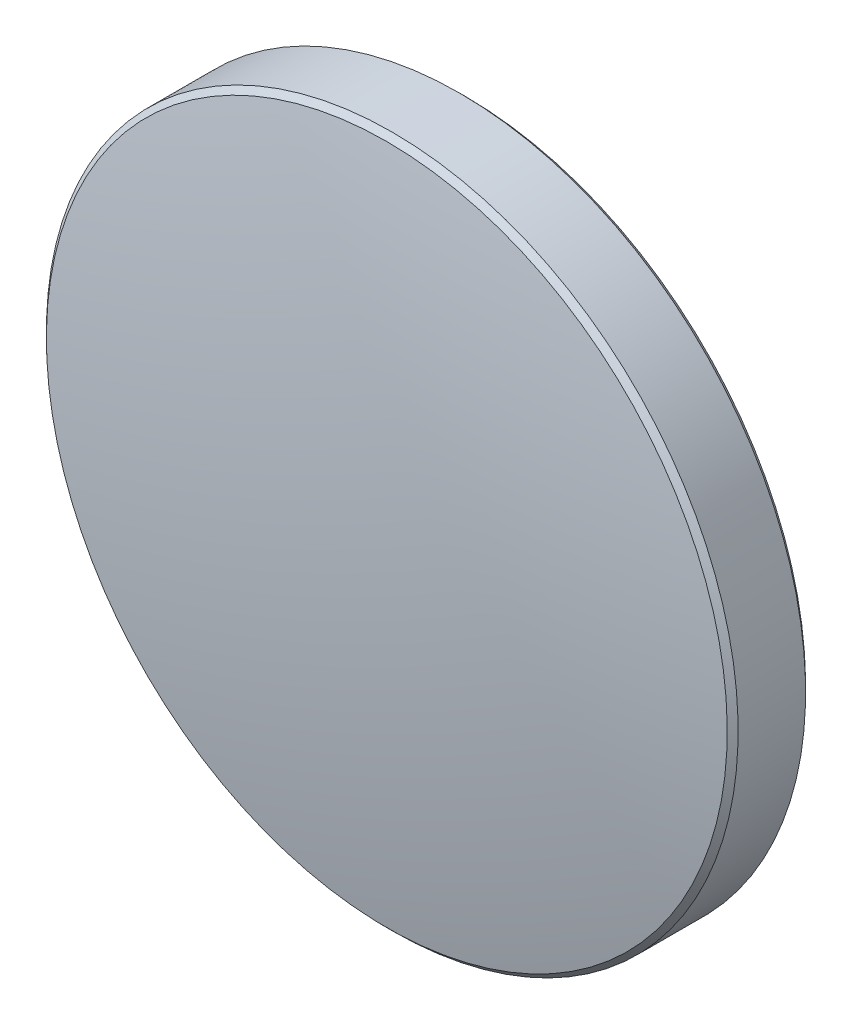
ISO-10303-21;
HEADER;
FILE_DESCRIPTION(('STEP AP214'),'2;1');
FILE_NAME('part.step','',(''),(''),'','','');
FILE_SCHEMA(('AUTOMOTIVE_DESIGN { 1 0 10303 214 1 1 1 1 }'));
ENDSEC;
DATA;
#1=APPLICATION_CONTEXT('core data for automotive mechanical design processes');
#2=APPLICATION_PROTOCOL_DEFINITION('international standard','automotive_design',2000,#1);
#3=PRODUCT_CONTEXT('',#1,'mechanical');
#4=PRODUCT('Part','Part','',(#3));
#5=PRODUCT_RELATED_PRODUCT_CATEGORY('part','',(#4));
#6=PRODUCT_DEFINITION_FORMATION('','',#4);
#7=PRODUCT_DEFINITION_CONTEXT('part definition',#1,'design');
#8=PRODUCT_DEFINITION('design','',#6,#7);
#9=PRODUCT_DEFINITION_SHAPE('','',#8);
#10=(LENGTH_UNIT() NAMED_UNIT(*) SI_UNIT(.MILLI.,.METRE.));
#11=(NAMED_UNIT(*) PLANE_ANGLE_UNIT() SI_UNIT($,.RADIAN.));
#12=(NAMED_UNIT(*) SI_UNIT($,.STERADIAN.) SOLID_ANGLE_UNIT());
#13=UNCERTAINTY_MEASURE_WITH_UNIT(LENGTH_MEASURE(1.E-05),#10,'distance_accuracy_value','');
#14=(GEOMETRIC_REPRESENTATION_CONTEXT(3) GLOBAL_UNCERTAINTY_ASSIGNED_CONTEXT((#13)) GLOBAL_UNIT_ASSIGNED_CONTEXT((#10,
#11,#12)) REPRESENTATION_CONTEXT('',''));
#15=CARTESIAN_POINT('',(0.,0.,0.));
#16=DIRECTION('',(0.,0.,1.));
#17=DIRECTION('',(1.,0.,0.));
#18=AXIS2_PLACEMENT_3D('',#15,#16,#17);
#19=CARTESIAN_POINT('',(0.,0.,-2.));
#20=DIRECTION('',(0.,0.,-1.));
#21=DIRECTION('',(0.,1.,0.));
#22=AXIS2_PLACEMENT_3D('',#19,#20,#21);
#23=CYLINDRICAL_SURFACE('',#22,12.7);
#24=CARTESIAN_POINT('',(0.,0.,0.678144155731215));
#25=DIRECTION('',(0.,0.,-1.));
#26=DIRECTION('',(0.,1.,0.));
#27=AXIS2_PLACEMENT_3D('',#24,#25,#26);
#28=CIRCLE('',#27,12.7);
#29=CARTESIAN_POINT('',(0.,12.7,0.678144155731161));
#30=VERTEX_POINT('',#29);
#31=EDGE_CURVE('E28',#30,#30,#28,.T.);
#32=ORIENTED_EDGE('',*,*,#31,.T.);
#33=EDGE_LOOP('',(#32));
#34=FACE_BOUND('',#33,.T.);
#35=CARTESIAN_POINT('',(0.,0.,-1.79999999999995));
#36=DIRECTION('',(0.,0.,-1.));
#37=DIRECTION('',(0.,1.,0.));
#38=AXIS2_PLACEMENT_3D('',#35,#36,#37);
#39=CIRCLE('',#38,12.7);
#40=CARTESIAN_POINT('',(0.,12.7,-1.8));
#41=VERTEX_POINT('',#40);
#42=EDGE_CURVE('E20',#41,#41,#39,.T.);
#43=ORIENTED_EDGE('',*,*,#42,.F.);
#44=EDGE_LOOP('',(#43));
#45=FACE_BOUND('',#44,.T.);
#46=ADVANCED_FACE('F13',(#34,#45),#23,.T.);
#47=CARTESIAN_POINT('',(0.,0.,-1.79999999999995));
#48=DIRECTION('',(0.,0.,1.));
#49=DIRECTION('',(0.,-1.,0.));
#50=AXIS2_PLACEMENT_3D('',#47,#48,#49);
#51=CONICAL_SURFACE('',#50,12.7,0.785398163397448);
#52=CARTESIAN_POINT('',(0.,0.,-1.99999999999995));
#53=DIRECTION('',(0.,0.,-1.));
#54=DIRECTION('',(0.,1.,0.));
#55=AXIS2_PLACEMENT_3D('',#52,#53,#54);
#56=CIRCLE('',#55,12.5);
#57=CARTESIAN_POINT('',(0.,12.5,-2.));
#58=VERTEX_POINT('',#57);
#59=EDGE_CURVE('E9',#58,#58,#56,.T.);
#60=ORIENTED_EDGE('',*,*,#59,.F.);
#61=EDGE_LOOP('',(#60));
#62=FACE_BOUND('',#61,.T.);
#63=ORIENTED_EDGE('',*,*,#42,.T.);
#64=EDGE_LOOP('',(#63));
#65=FACE_BOUND('',#64,.T.);
#66=ADVANCED_FACE('F49',(#62,#65),#51,.T.);
#67=CARTESIAN_POINT('',(0.,0.,-2.));
#68=DIRECTION('',(0.,0.,-1.));
#69=DIRECTION('',(0.,1.,0.));
#70=AXIS2_PLACEMENT_3D('',#67,#68,#69);
#71=PLANE('',#70);
#72=ORIENTED_EDGE('',*,*,#59,.T.);
#73=EDGE_LOOP('',(#72));
#74=FACE_BOUND('',#73,.T.);
#75=ADVANCED_FACE('F15',(#74),#71,.T.);
#76=CARTESIAN_POINT('',(0.,0.,0.878144155731214));
#77=DIRECTION('',(0.,0.,-1.));
#78=DIRECTION('',(0.,1.,0.));
#79=AXIS2_PLACEMENT_3D('',#76,#77,#78);
#80=CONICAL_SURFACE('',#79,12.5,0.785398163397456);
#81=ORIENTED_EDGE('',*,*,#31,.F.);
#82=EDGE_LOOP('',(#81));
#83=FACE_BOUND('',#82,.T.);
#84=CARTESIAN_POINT('',(0.,0.,0.878144155731214));
#85=DIRECTION('',(0.,0.,-1.));
#86=DIRECTION('',(0.,1.,0.));
#87=AXIS2_PLACEMENT_3D('',#84,#85,#86);
#88=CIRCLE('',#87,12.5);
#89=CARTESIAN_POINT('',(0.,12.5,0.878144155731161));
#90=VERTEX_POINT('',#89);
#91=EDGE_CURVE('E24',#90,#90,#88,.T.);
#92=ORIENTED_EDGE('',*,*,#91,.T.);
#93=EDGE_LOOP('',(#92));
#94=FACE_BOUND('',#93,.T.);
#95=ADVANCED_FACE('F36',(#83,#94),#80,.T.);
#96=CARTESIAN_POINT('',(0.,0.,-68.2));
#97=DIRECTION('',(0.,0.,-1.));
#98=DIRECTION('',(0.,1.,0.));
#99=AXIS2_PLACEMENT_3D('',#96,#97,#98);
#100=SPHERICAL_SURFACE('',#99,70.1999999999999);
#101=ORIENTED_EDGE('',*,*,#91,.F.);
#102=EDGE_LOOP('',(#101));
#103=FACE_BOUND('',#102,.T.);
#104=ADVANCED_FACE('F39',(#103),#100,.T.);
#105=CLOSED_SHELL('',(#46,#66,#75,#95,#104));
#106=MANIFOLD_SOLID_BREP('B1',#105);
#107=ADVANCED_BREP_SHAPE_REPRESENTATION('',(#18,#106),#14);
#108=SHAPE_DEFINITION_REPRESENTATION(#9,#107);
ENDSEC;
END-ISO-10303-21;
